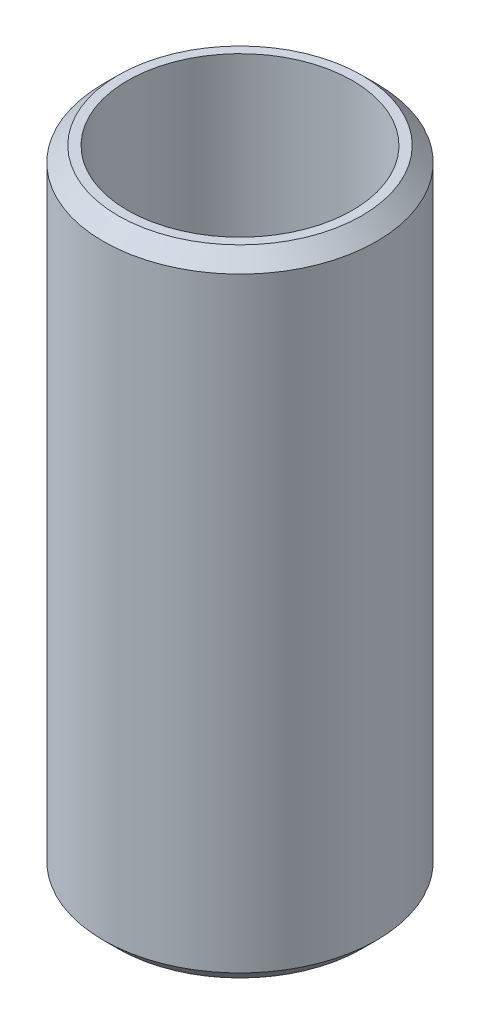
ISO-10303-21;
HEADER;
FILE_DESCRIPTION(('STEP AP214'),'2;1');
FILE_NAME('part.step','',(''),(''),'','','');
FILE_SCHEMA(('AUTOMOTIVE_DESIGN { 1 0 10303 214 1 1 1 1 }'));
ENDSEC;
DATA;
#1=APPLICATION_CONTEXT('core data for automotive mechanical design processes');
#2=APPLICATION_PROTOCOL_DEFINITION('international standard','automotive_design',2000,#1);
#3=PRODUCT_CONTEXT('',#1,'mechanical');
#4=PRODUCT('Part','Part','',(#3));
#5=PRODUCT_RELATED_PRODUCT_CATEGORY('part','',(#4));
#6=PRODUCT_DEFINITION_FORMATION('','',#4);
#7=PRODUCT_DEFINITION_CONTEXT('part definition',#1,'design');
#8=PRODUCT_DEFINITION('design','',#6,#7);
#9=PRODUCT_DEFINITION_SHAPE('','',#8);
#10=(LENGTH_UNIT() NAMED_UNIT(*) SI_UNIT(.MILLI.,.METRE.));
#11=(NAMED_UNIT(*) PLANE_ANGLE_UNIT() SI_UNIT($,.RADIAN.));
#12=(NAMED_UNIT(*) SI_UNIT($,.STERADIAN.) SOLID_ANGLE_UNIT());
#13=UNCERTAINTY_MEASURE_WITH_UNIT(LENGTH_MEASURE(1.E-05),#10,'distance_accuracy_value','');
#14=(GEOMETRIC_REPRESENTATION_CONTEXT(3) GLOBAL_UNCERTAINTY_ASSIGNED_CONTEXT((#13)) GLOBAL_UNIT_ASSIGNED_CONTEXT((#10,
#11,#12)) REPRESENTATION_CONTEXT('',''));
#15=CARTESIAN_POINT('',(0.,0.,0.));
#16=DIRECTION('',(0.,0.,1.));
#17=DIRECTION('',(1.,0.,0.));
#18=AXIS2_PLACEMENT_3D('',#15,#16,#17);
#19=CARTESIAN_POINT('',(0.,197.48548171518,0.));
#20=DIRECTION('',(0.,-1.,0.));
#21=DIRECTION('',(0.,0.,-1.));
#22=AXIS2_PLACEMENT_3D('',#19,#20,#21);
#23=CYLINDRICAL_SURFACE('',#22,42.5);
#24=CARTESIAN_POINT('',(0.,192.868941923743,0.));
#25=DIRECTION('',(0.,1.,0.));
#26=DIRECTION('',(0.,0.,1.));
#27=AXIS2_PLACEMENT_3D('',#24,#25,#26);
#28=CIRCLE('',#27,42.5);
#29=CARTESIAN_POINT('',(0.,192.868941923743,42.5));
#30=VERTEX_POINT('',#29);
#31=EDGE_CURVE('E50',#30,#30,#28,.F.);
#32=ORIENTED_EDGE('',*,*,#31,.T.);
#33=EDGE_LOOP('',(#32));
#34=FACE_BOUND('',#33,.T.);
#35=CARTESIAN_POINT('',(0.,4.61653979143736,0.));
#36=DIRECTION('',(0.,1.,0.));
#37=DIRECTION('',(0.,0.,1.));
#38=AXIS2_PLACEMENT_3D('',#35,#36,#37);
#39=CIRCLE('',#38,42.5);
#40=CARTESIAN_POINT('',(0.,4.61653979143736,42.5));
#41=VERTEX_POINT('',#40);
#42=EDGE_CURVE('E51',#41,#41,#39,.T.);
#43=ORIENTED_EDGE('',*,*,#42,.T.);
#44=EDGE_LOOP('',(#43));
#45=FACE_BOUND('',#44,.T.);
#46=ADVANCED_FACE('F39',(#34,#45),#23,.T.);
#47=CARTESIAN_POINT('',(0.,197.48548171518,0.));
#48=DIRECTION('',(0.,1.,0.));
#49=DIRECTION('',(0.,0.,1.));
#50=AXIS2_PLACEMENT_3D('',#47,#48,#49);
#51=PLANE('',#50);
#52=CARTESIAN_POINT('',(0.,197.48548171518,0.));
#53=DIRECTION('',(0.,1.,0.));
#54=DIRECTION('',(0.,0.,1.));
#55=AXIS2_PLACEMENT_3D('',#52,#53,#54);
#56=CIRCLE('',#55,37.8834602085626);
#57=CARTESIAN_POINT('',(0.,197.48548171518,37.8834602085626));
#58=VERTEX_POINT('',#57);
#59=EDGE_CURVE('E54',#58,#58,#56,.T.);
#60=ORIENTED_EDGE('',*,*,#59,.T.);
#61=EDGE_LOOP('',(#60));
#62=FACE_BOUND('',#61,.T.);
#63=CARTESIAN_POINT('',(0.,197.48548171518,0.));
#64=DIRECTION('',(0.,1.,0.));
#65=DIRECTION('',(0.,0.,1.));
#66=AXIS2_PLACEMENT_3D('',#63,#64,#65);
#67=CIRCLE('',#66,34.9719587759579);
#68=CARTESIAN_POINT('',(0.,197.48548171518,34.9719587759579));
#69=VERTEX_POINT('',#68);
#70=EDGE_CURVE('E58',#69,#69,#67,.T.);
#71=ORIENTED_EDGE('',*,*,#70,.F.);
#72=EDGE_LOOP('',(#71));
#73=FACE_BOUND('',#72,.T.);
#74=ADVANCED_FACE('F69',(#62,#73),#51,.T.);
#75=CARTESIAN_POINT('',(0.,0.,0.));
#76=DIRECTION('',(0.,1.,0.));
#77=DIRECTION('',(0.,0.,1.));
#78=AXIS2_PLACEMENT_3D('',#75,#76,#77);
#79=PLANE('',#78);
#80=CARTESIAN_POINT('',(0.,0.,0.));
#81=DIRECTION('',(0.,1.,0.));
#82=DIRECTION('',(0.,0.,1.));
#83=AXIS2_PLACEMENT_3D('',#80,#81,#82);
#84=CIRCLE('',#83,37.8834602085626);
#85=CARTESIAN_POINT('',(0.,0.,37.8834602085626));
#86=VERTEX_POINT('',#85);
#87=EDGE_CURVE('E10',#86,#86,#84,.F.);
#88=ORIENTED_EDGE('',*,*,#87,.T.);
#89=EDGE_LOOP('',(#88));
#90=FACE_BOUND('',#89,.T.);
#91=CARTESIAN_POINT('',(0.,0.,0.));
#92=DIRECTION('',(0.,1.,0.));
#93=DIRECTION('',(0.,0.,1.));
#94=AXIS2_PLACEMENT_3D('',#91,#92,#93);
#95=CIRCLE('',#94,34.9719587759579);
#96=CARTESIAN_POINT('',(0.,0.,34.9719587759579));
#97=VERTEX_POINT('',#96);
#98=EDGE_CURVE('E63',#97,#97,#95,.T.);
#99=ORIENTED_EDGE('',*,*,#98,.T.);
#100=EDGE_LOOP('',(#99));
#101=FACE_BOUND('',#100,.T.);
#102=ADVANCED_FACE('F75',(#90,#101),#79,.F.);
#103=CARTESIAN_POINT('',(0.,197.48548171518,0.));
#104=DIRECTION('',(0.,-1.,0.));
#105=DIRECTION('',(0.,0.,-1.));
#106=AXIS2_PLACEMENT_3D('',#103,#104,#105);
#107=CYLINDRICAL_SURFACE('',#106,34.9719587759579);
#108=ORIENTED_EDGE('',*,*,#70,.T.);
#109=EDGE_LOOP('',(#108));
#110=FACE_BOUND('',#109,.T.);
#111=ORIENTED_EDGE('',*,*,#98,.F.);
#112=EDGE_LOOP('',(#111));
#113=FACE_BOUND('',#112,.T.);
#114=ADVANCED_FACE('F70',(#110,#113),#107,.F.);
#115=CARTESIAN_POINT('',(0.,197.48548171518,0.));
#116=DIRECTION('',(0.,-1.,0.));
#117=DIRECTION('',(0.,0.,-1.));
#118=AXIS2_PLACEMENT_3D('',#115,#116,#117);
#119=CONICAL_SURFACE('',#118,37.8834602085626,0.785398163397445);
#120=ORIENTED_EDGE('',*,*,#31,.F.);
#121=EDGE_LOOP('',(#120));
#122=FACE_BOUND('',#121,.T.);
#123=ORIENTED_EDGE('',*,*,#59,.F.);
#124=EDGE_LOOP('',(#123));
#125=FACE_BOUND('',#124,.T.);
#126=ADVANCED_FACE('F81',(#122,#125),#119,.T.);
#127=CARTESIAN_POINT('',(0.,4.61653979143736,0.));
#128=DIRECTION('',(0.,1.,0.));
#129=DIRECTION('',(0.,0.,1.));
#130=AXIS2_PLACEMENT_3D('',#127,#128,#129);
#131=CONICAL_SURFACE('',#130,42.5,0.785398163397451);
#132=ORIENTED_EDGE('',*,*,#87,.F.);
#133=EDGE_LOOP('',(#132));
#134=FACE_BOUND('',#133,.T.);
#135=ORIENTED_EDGE('',*,*,#42,.F.);
#136=EDGE_LOOP('',(#135));
#137=FACE_BOUND('',#136,.T.);
#138=ADVANCED_FACE('F45',(#134,#137),#131,.T.);
#139=CLOSED_SHELL('',(#46,#74,#102,#114,#126,#138));
#140=MANIFOLD_SOLID_BREP('B2',#139);
#141=ADVANCED_BREP_SHAPE_REPRESENTATION('',(#18,#140),#14);
#142=SHAPE_DEFINITION_REPRESENTATION(#9,#141);
ENDSEC;
END-ISO-10303-21;
